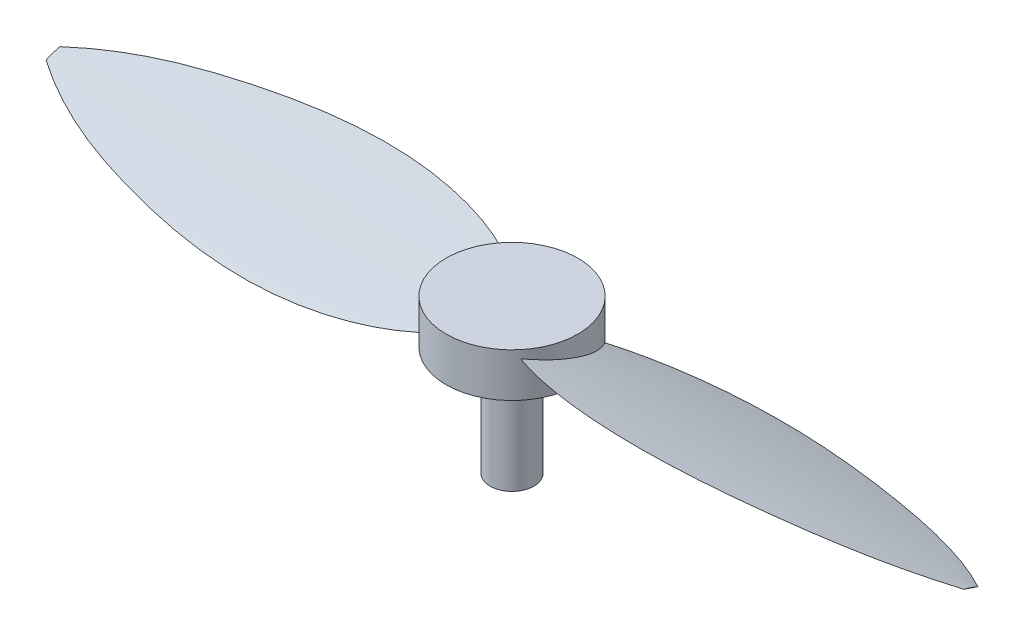
ISO-10303-21;
HEADER;
FILE_DESCRIPTION(('STEP AP214'),'2;1');
FILE_NAME('part.step','',(''),(''),'','','');
FILE_SCHEMA(('AUTOMOTIVE_DESIGN { 1 0 10303 214 1 1 1 1 }'));
ENDSEC;
DATA;
#1=APPLICATION_CONTEXT('core data for automotive mechanical design processes');
#2=APPLICATION_PROTOCOL_DEFINITION('international standard','automotive_design',2000,#1);
#3=PRODUCT_CONTEXT('',#1,'mechanical');
#4=PRODUCT('Part','Part','',(#3));
#5=PRODUCT_RELATED_PRODUCT_CATEGORY('part','',(#4));
#6=PRODUCT_DEFINITION_FORMATION('','',#4);
#7=PRODUCT_DEFINITION_CONTEXT('part definition',#1,'design');
#8=PRODUCT_DEFINITION('design','',#6,#7);
#9=PRODUCT_DEFINITION_SHAPE('','',#8);
#10=(LENGTH_UNIT() NAMED_UNIT(*) SI_UNIT(.MILLI.,.METRE.));
#11=(NAMED_UNIT(*) PLANE_ANGLE_UNIT() SI_UNIT($,.RADIAN.));
#12=(NAMED_UNIT(*) SI_UNIT($,.STERADIAN.) SOLID_ANGLE_UNIT());
#13=UNCERTAINTY_MEASURE_WITH_UNIT(LENGTH_MEASURE(1.E-05),#10,'distance_accuracy_value','');
#14=(GEOMETRIC_REPRESENTATION_CONTEXT(3) GLOBAL_UNCERTAINTY_ASSIGNED_CONTEXT((#13)) GLOBAL_UNIT_ASSIGNED_CONTEXT((#10,
#11,#12)) REPRESENTATION_CONTEXT('',''));
#15=CARTESIAN_POINT('',(0.,0.,0.));
#16=DIRECTION('',(0.,0.,1.));
#17=DIRECTION('',(1.,0.,0.));
#18=AXIS2_PLACEMENT_3D('',#15,#16,#17);
#19=CARTESIAN_POINT('',(0.,10.,0.));
#20=DIRECTION('',(0.,-1.,0.));
#21=DIRECTION('',(0.,0.,-1.));
#22=AXIS2_PLACEMENT_3D('',#19,#20,#21);
#23=CYLINDRICAL_SURFACE('',#22,15.);
#24=CARTESIAN_POINT('',(-11.5286884201092,8.19877308618375,-9.5963192585512));
#25=CARTESIAN_POINT('',(-11.6652468513857,8.16313376279476,-9.43226225900415));
#26=CARTESIAN_POINT('',(-11.7981021452762,8.12581339183943,-9.2655318761139));
#27=CARTESIAN_POINT('',(-12.0562533383928,8.04804373134757,-8.92704145636138));
#28=CARTESIAN_POINT('',(-12.1815497240768,8.00759464354462,-8.75528174422355));
#29=CARTESIAN_POINT('',(-12.5457381490418,7.88195144019499,-8.23312908790252));
#30=CARTESIAN_POINT('',(-12.7731079322483,7.79241429795959,-7.87564785034535));
#31=CARTESIAN_POINT('',(-13.1952518950184,7.60360440650161,-7.14581308880327));
#32=CARTESIAN_POINT('',(-13.3901111788479,7.50435819036564,-6.77350165916444));
#33=CARTESIAN_POINT('',(-13.7471882013149,7.29715981269266,-6.01582914224747));
#34=CARTESIAN_POINT('',(-13.9094027474687,7.18920680112154,-5.63046678295822));
#35=CARTESIAN_POINT('',(-14.2003380869817,6.96586337781367,-4.85010908634994));
#36=CARTESIAN_POINT('',(-14.3291079292759,6.85048417077096,-4.45512879561025));
#37=CARTESIAN_POINT('',(-14.5530919258413,6.61313035568563,-3.65773330904733));
#38=CARTESIAN_POINT('',(-14.6483070908767,6.49115594643733,-3.25531833756263));
#39=CARTESIAN_POINT('',(-14.8050469397441,6.24147187559218,-2.4455532079796));
#40=CARTESIAN_POINT('',(-14.8665573774308,6.11375981347155,-2.03820103728969));
#41=CARTESIAN_POINT('',(-14.9558402523449,5.85351830264545,-1.22133874813671));
#42=CARTESIAN_POINT('',(-14.9836111429985,5.72098863339433,-0.811828531615901));
#43=CARTESIAN_POINT('',(-15.0061253604905,5.44534519482288,0.0269030970964824));
#44=CARTESIAN_POINT('',(-14.9991792996405,5.30203130339145,0.456104627934616));
#45=CARTESIAN_POINT('',(-14.9487203797644,5.01197436522825,1.31118278301544));
#46=CARTESIAN_POINT('',(-14.9052066720966,4.86523123898953,1.73705932986224));
#47=CARTESIAN_POINT('',(-14.7821357483399,4.56916367479017,2.58285965532117));
#48=CARTESIAN_POINT('',(-14.7025637802997,4.41983820442863,3.00278092495886));
#49=CARTESIAN_POINT('',(-14.5080797146132,4.11952521954245,3.83376108207154));
#50=CARTESIAN_POINT('',(-14.3931660868477,3.96853763332938,4.24481958500781));
#51=CARTESIAN_POINT('',(-14.1155761261012,3.65047085655585,5.09613612538101));
#52=CARTESIAN_POINT('',(-13.9492597264101,3.48329980241055,5.53517568483763));
#53=CARTESIAN_POINT('',(-13.5762147320649,3.1487905849986,6.39580314431696));
#54=CARTESIAN_POINT('',(-13.369481929107,2.98145240613703,6.8173892214753));
#55=CARTESIAN_POINT('',(-13.0303744450282,2.73080894205192,7.43400913507674));
#56=CARTESIAN_POINT('',(-12.9124390587029,2.64728095576982,7.63701808369219));
#57=CARTESIAN_POINT('',(-12.667131938539,2.48037916323714,8.0373414757037));
#58=CARTESIAN_POINT('',(-12.5397601853097,2.39700535730374,8.23465590739691));
#59=CARTESIAN_POINT('',(-12.2758632478529,2.2304308946195,8.62312667584135));
#60=CARTESIAN_POINT('',(-12.1393383055586,2.14723023335207,8.81428317515879));
#61=CARTESIAN_POINT('',(-11.8574416510213,1.98094015934387,9.19000941626488));
#62=CARTESIAN_POINT('',(-11.712069896342,1.8978507471387,9.37457912645142));
#63=CARTESIAN_POINT('',(-11.5624302243646,1.81478751264011,9.55563746207968));
#64=B_SPLINE_CURVE_WITH_KNOTS('',3,(#24,#25,#26,#27,#28,#29,#30,#31,#32,#33,#34,#35,#36,#37,#38,
#39,#40,#41,#42,#43,#44,#45,#46,#47,#48,#49,#50,#51,#52,#53,#54,#55,#56,#57,#58,#59,#60,#61,#62,
#63),.UNSPECIFIED.,.F.,.F.,(4,2,2,2,2,2,2,2,2,2,2,2,2,2,2,2,2,2,2,4),(0.,0.64911060452845,
1.29817939049827,2.59547036385044,3.88931018204641,5.18327646954853,6.47533421291324,
7.76735303242024,9.05991753554307,10.3525412857904,11.708661204026,13.0648125952104,
14.4215193089783,15.7782847697149,17.2714365832381,18.7647439520725,19.5121297081154,
20.2595170000091,21.0068845450722,21.7542556753757),.UNSPECIFIED.);
#65=CARTESIAN_POINT('',(-11.5286884201091,8.19877308618375,-9.59631925855125));
#66=VERTEX_POINT('',#65);
#67=CARTESIAN_POINT('',(-11.5624302243646,1.81478751264011,9.55563746207969));
#68=VERTEX_POINT('',#67);
#69=EDGE_CURVE('E84',#66,#68,#64,.T.);
#70=ORIENTED_EDGE('',*,*,#69,.T.);
#71=CARTESIAN_POINT('',(0.,5.,0.));
#72=DIRECTION('',(0.,-0.948683298050514,-0.316227766016838));
#73=DIRECTION('',(0.,-0.316227766016838,0.948683298050514));
#74=AXIS2_PLACEMENT_3D('',#71,#72,#73);
#75=ELLIPSE('',#74,15.8113883008419,15.);
#76=EDGE_CURVE('E42',#68,#66,#75,.T.);
#77=ORIENTED_EDGE('',*,*,#76,.T.);
#78=EDGE_LOOP('',(#70,#77));
#79=FACE_BOUND('',#78,.T.);
#80=CARTESIAN_POINT('',(11.5286884201092,8.19877308618375,9.5963192585512));
#81=CARTESIAN_POINT('',(11.6652468513857,8.16313376279476,9.43226225900415));
#82=CARTESIAN_POINT('',(11.7981021452762,8.12581339183943,9.2655318761139));
#83=CARTESIAN_POINT('',(12.0562533383928,8.04804373134757,8.92704145636138));
#84=CARTESIAN_POINT('',(12.1815497240768,8.00759464354462,8.75528174422355));
#85=CARTESIAN_POINT('',(12.5457381490418,7.88195144019499,8.23312908790252));
#86=CARTESIAN_POINT('',(12.7731079322483,7.79241429795959,7.87564785034535));
#87=CARTESIAN_POINT('',(13.1952518950184,7.60360440650161,7.14581308880327));
#88=CARTESIAN_POINT('',(13.3901111788479,7.50435819036564,6.77350165916444));
#89=CARTESIAN_POINT('',(13.7471882013149,7.29715981269266,6.01582914224747));
#90=CARTESIAN_POINT('',(13.9094027474687,7.18920680112154,5.63046678295822));
#91=CARTESIAN_POINT('',(14.2003380869817,6.96586337781367,4.85010908634993));
#92=CARTESIAN_POINT('',(14.3291079292759,6.85048417077096,4.45512879561024));
#93=CARTESIAN_POINT('',(14.5530919258413,6.61313035568563,3.65773330904732));
#94=CARTESIAN_POINT('',(14.6483070908767,6.49115594643733,3.25531833756262));
#95=CARTESIAN_POINT('',(14.8050469397441,6.24147187559218,2.44555320797959));
#96=CARTESIAN_POINT('',(14.8665573774308,6.11375981347155,2.03820103728968));
#97=CARTESIAN_POINT('',(14.9558402523449,5.85351830264545,1.2213387481367));
#98=CARTESIAN_POINT('',(14.9836111429985,5.72098863339432,0.811828531615893));
#99=CARTESIAN_POINT('',(15.0061253604905,5.44534519482288,-0.0269030970964894));
#100=CARTESIAN_POINT('',(14.9991792996405,5.30203130339145,-0.456104627934623));
#101=CARTESIAN_POINT('',(14.9487203797644,5.01197436522824,-1.31118278301545));
#102=CARTESIAN_POINT('',(14.9052066720966,4.86523123898953,-1.73705932986224));
#103=CARTESIAN_POINT('',(14.7821357483399,4.56916367479017,-2.58285965532117));
#104=CARTESIAN_POINT('',(14.7025637802997,4.41983820442862,-3.00278092495886));
#105=CARTESIAN_POINT('',(14.5080797146132,4.11952521954245,-3.83376108207155));
#106=CARTESIAN_POINT('',(14.3931660868477,3.96853763332937,-4.24481958500781));
#107=CARTESIAN_POINT('',(14.1155761261012,3.65047085655584,-5.09613612538102));
#108=CARTESIAN_POINT('',(13.9492597264101,3.48329980241054,-5.53517568483764));
#109=CARTESIAN_POINT('',(13.5762147320649,3.1487905849986,-6.39580314431696));
#110=CARTESIAN_POINT('',(13.369481929107,2.98145240613703,-6.8173892214753));
#111=CARTESIAN_POINT('',(13.0303744450282,2.73080894205192,-7.43400913507674));
#112=CARTESIAN_POINT('',(12.9124390587029,2.64728095576982,-7.63701808369219));
#113=CARTESIAN_POINT('',(12.667131938539,2.48037916323714,-8.0373414757037));
#114=CARTESIAN_POINT('',(12.5397601853097,2.39700535730374,-8.23465590739691));
#115=CARTESIAN_POINT('',(12.2758632478529,2.2304308946195,-8.62312667584136));
#116=CARTESIAN_POINT('',(12.1393383055586,2.14723023335207,-8.8142831751588));
#117=CARTESIAN_POINT('',(11.8574416510213,1.98094015934387,-9.19000941626488));
#118=CARTESIAN_POINT('',(11.712069896342,1.8978507471387,-9.37457912645142));
#119=CARTESIAN_POINT('',(11.5624302243646,1.81478751264011,-9.55563746207968));
#120=B_SPLINE_CURVE_WITH_KNOTS('',3,(#80,#81,#82,#83,#84,#85,#86,#87,#88,#89,#90,#91,#92,#93,
#94,#95,#96,#97,#98,#99,#100,#101,#102,#103,#104,#105,#106,#107,#108,#109,#110,#111,#112,#113,
#114,#115,#116,#117,#118,#119),.UNSPECIFIED.,.F.,.F.,(4,2,2,2,2,2,2,2,2,2,2,2,2,2,2,2,2,2,2,4),
(0.,0.649110604528452,1.29817939049827,2.59547036385044,3.88931018204642,5.18327646954854,
6.47533421291325,7.76735303242025,9.05991753554308,10.3525412857905,11.708661204026,
13.0648125952104,14.4215193089783,15.7782847697149,17.2714365832382,18.7647439520725,
19.5121297081154,20.2595170000091,21.0068845450722,21.7542556753757),.UNSPECIFIED.);
#121=CARTESIAN_POINT('',(11.5286884201091,8.19877308618375,9.59631925855125));
#122=VERTEX_POINT('',#121);
#123=CARTESIAN_POINT('',(11.5624302243646,1.81478751264011,-9.55563746207969));
#124=VERTEX_POINT('',#123);
#125=EDGE_CURVE('E122',#122,#124,#120,.T.);
#126=ORIENTED_EDGE('',*,*,#125,.T.);
#127=CARTESIAN_POINT('',(0.,5.,0.));
#128=DIRECTION('',(0.,-0.948683298050514,0.316227766016838));
#129=DIRECTION('',(0.,-0.316227766016838,-0.948683298050514));
#130=AXIS2_PLACEMENT_3D('',#127,#128,#129);
#131=ELLIPSE('',#130,15.8113883008419,15.);
#132=EDGE_CURVE('E132',#124,#122,#131,.T.);
#133=ORIENTED_EDGE('',*,*,#132,.T.);
#134=EDGE_LOOP('',(#126,#133));
#135=FACE_BOUND('',#134,.T.);
#136=CARTESIAN_POINT('',(0.,10.,0.));
#137=DIRECTION('',(0.,1.,0.));
#138=DIRECTION('',(0.,0.,1.));
#139=AXIS2_PLACEMENT_3D('',#136,#137,#138);
#140=CIRCLE('',#139,15.);
#141=CARTESIAN_POINT('',(0.,10.,15.));
#142=VERTEX_POINT('',#141);
#143=EDGE_CURVE('E119',#142,#142,#140,.T.);
#144=ORIENTED_EDGE('',*,*,#143,.F.);
#145=EDGE_LOOP('',(#144));
#146=FACE_BOUND('',#145,.T.);
#147=CARTESIAN_POINT('',(0.,0.,0.));
#148=DIRECTION('',(0.,1.,0.));
#149=DIRECTION('',(0.,0.,1.));
#150=AXIS2_PLACEMENT_3D('',#147,#148,#149);
#151=CIRCLE('',#150,15.);
#152=CARTESIAN_POINT('',(0.,0.,15.));
#153=VERTEX_POINT('',#152);
#154=EDGE_CURVE('E116',#153,#153,#151,.T.);
#155=ORIENTED_EDGE('',*,*,#154,.T.);
#156=EDGE_LOOP('',(#155));
#157=FACE_BOUND('',#156,.T.);
#158=ADVANCED_FACE('F38',(#79,#135,#146,#157),#23,.T.);
#159=CARTESIAN_POINT('',(0.,10.,0.));
#160=DIRECTION('',(0.,1.,0.));
#161=DIRECTION('',(0.,0.,1.));
#162=AXIS2_PLACEMENT_3D('',#159,#160,#161);
#163=PLANE('',#162);
#164=ORIENTED_EDGE('',*,*,#143,.T.);
#165=EDGE_LOOP('',(#164));
#166=FACE_BOUND('',#165,.T.);
#167=ADVANCED_FACE('F152',(#166),#163,.T.);
#168=CARTESIAN_POINT('',(0.,0.,0.));
#169=DIRECTION('',(0.,1.,0.));
#170=DIRECTION('',(0.,0.,1.));
#171=AXIS2_PLACEMENT_3D('',#168,#169,#170);
#172=PLANE('',#171);
#173=CARTESIAN_POINT('',(0.,0.,0.));
#174=DIRECTION('',(0.,-1.,0.));
#175=DIRECTION('',(0.,0.,-1.));
#176=AXIS2_PLACEMENT_3D('',#173,#174,#175);
#177=CIRCLE('',#176,5.);
#178=CARTESIAN_POINT('',(0.,0.,-5.));
#179=VERTEX_POINT('',#178);
#180=EDGE_CURVE('E11',#179,#179,#177,.T.);
#181=ORIENTED_EDGE('',*,*,#180,.F.);
#182=EDGE_LOOP('',(#181));
#183=FACE_BOUND('',#182,.T.);
#184=ORIENTED_EDGE('',*,*,#154,.F.);
#185=EDGE_LOOP('',(#184));
#186=FACE_BOUND('',#185,.T.);
#187=ADVANCED_FACE('F141',(#183,#186),#172,.F.);
#188=CARTESIAN_POINT('',(0.,4.51721062059758,-1.44836813820728));
#189=CARTESIAN_POINT('',(7.83558440334098,2.09173103343399,-8.72480689969806));
#190=CARTESIAN_POINT('',(32.2825415930226,-1.35880672951688,-19.0764201885507));
#191=CARTESIAN_POINT('',(69.0409623272103,-0.184551081957399,-15.5536532458721));
#192=CARTESIAN_POINT('',(95.395608688495,2.61364085490183,-7.15907743529444));
#193=CARTESIAN_POINT('',(105.,4.62227655082445,-1.13317034752666));
#194=CARTESIAN_POINT('',(0.,5.33433175875963,-0.319592559802048));
#195=CARTESIAN_POINT('',(7.8716523643627,4.43790876843386,-3.00886153077939));
#196=CARTESIAN_POINT('',(32.2458731746542,3.69918665458095,-7.00022448274553));
#197=CARTESIAN_POINT('',(69.0701995461473,3.97838035331164,-5.74736592884639));
#198=CARTESIAN_POINT('',(95.3671543895042,4.33272047504771,-2.36632542448842));
#199=CARTESIAN_POINT('',(105.,5.082910494969,-0.11575536472461));
#200=CARTESIAN_POINT('',(0.,5.78518065127528,1.03295411774491));
#201=CARTESIAN_POINT('',(7.90772032538442,6.41781425778733,2.93085493728102));
#202=CARTESIAN_POINT('',(32.2092047562859,7.82176937210657,5.3675236698313));
#203=CARTESIAN_POINT('',(69.0994367650842,7.34911116079975,4.36482649361805));
#204=CARTESIAN_POINT('',(95.3387000905133,5.94529093982802,2.47138596985254));
#205=CARTESIAN_POINT('',(105.,5.43703528374799,0.94661900161237));
#206=CARTESIAN_POINT('',(0.,5.80874908778878,2.42624726336633));
#207=CARTESIAN_POINT('',(7.94378828640614,7.97043929113864,8.91131787341588));
#208=CARTESIAN_POINT('',(32.1725363379175,11.0210920883114,18.0632762649341));
#209=CARTESIAN_POINT('',(69.1286739840212,9.90253840279994,14.7076152084));
#210=CARTESIAN_POINT('',(95.3102457915224,7.44567845019493,7.33703535058488));
#211=CARTESIAN_POINT('',(105.,5.67897711811358,2.03693135434074));
#212=B_SPLINE_SURFACE_WITH_KNOTS('',3,3,((#188,#189,#190,#191,#192,#193),(#194,#195,#196,#197,
#198,#199),(#200,#201,#202,#203,#204,#205),(#206,#207,#208,#209,#210,#211)),.UNSPECIFIED.,.F.,
.F.,.F.,(4,4),(4,1,1,4),(0.,1.),(0.,0.246738655582114,0.711329046792689,1.),.UNSPECIFIED.);
#213=CARTESIAN_POINT('',(0.,5.80874908778878,2.42624726336633));
#214=CARTESIAN_POINT('',(7.94378828640613,7.97043929113865,8.91131787341594));
#215=CARTESIAN_POINT('',(32.1725363379175,11.0210920883114,18.0632762649343));
#216=CARTESIAN_POINT('',(69.1286739840212,9.90253840280002,14.7076152084));
#217=CARTESIAN_POINT('',(95.3102457915224,7.44567845019497,7.3370353505849));
#218=CARTESIAN_POINT('',(105.,5.67897711811358,2.03693135434074));
#219=B_SPLINE_CURVE_WITH_KNOTS('',3,(#213,#214,#215,#216,#217,#218),.UNSPECIFIED.,.F.,.F.,(4,1,
1,4),(0.,0.246738655582114,0.711329046792689,1.),.UNSPECIFIED.);
#220=CARTESIAN_POINT('',(105.,5.67897711811358,2.03693135434074));
#221=VERTEX_POINT('',#220);
#222=EDGE_CURVE('E93',#221,#122,#219,.F.);
#223=CARTESIAN_POINT('',(105.,-10.1258959906816,5.54405477845723));
#224=DIRECTION('',(1.,0.,0.));
#225=DIRECTION('',(0.,0.,1.));
#226=AXIS2_PLACEMENT_3D('',#223,#224,#225);
#227=CIRCLE('',#226,16.1893152633798);
#228=CARTESIAN_POINT('',(105.,4.62227655082445,-1.13317034752666));
#229=VERTEX_POINT('',#228);
#230=EDGE_CURVE('E102',#229,#221,#227,.T.);
#231=CARTESIAN_POINT('',(0.,4.51721062059757,-1.44836813820728));
#232=CARTESIAN_POINT('',(7.83558440334098,2.09173103343397,-8.72480689969808));
#233=CARTESIAN_POINT('',(32.2825415930226,-1.3588067295169,-19.0764201885507));
#234=CARTESIAN_POINT('',(69.0409623272103,-0.184551081957358,-15.5536532458721));
#235=CARTESIAN_POINT('',(95.395608688495,2.61364085490185,-7.15907743529444));
#236=CARTESIAN_POINT('',(105.,4.62227655082445,-1.13317034752666));
#237=B_SPLINE_CURVE_WITH_KNOTS('',3,(#231,#232,#233,#234,#235,#236),.UNSPECIFIED.,.F.,.F.,(4,1,
1,4),(0.,0.246738655582114,0.711329046792689,1.),.UNSPECIFIED.);
#238=EDGE_CURVE('E62',#124,#229,#237,.T.);
#239=ORIENTED_EDGE('',*,*,#125,.F.);
#240=ORIENTED_EDGE('',*,*,#222,.F.);
#241=ORIENTED_EDGE('',*,*,#230,.F.);
#242=ORIENTED_EDGE('',*,*,#238,.F.);
#243=EDGE_LOOP('',(#239,#240,#241,#242));
#244=FACE_BOUND('',#243,.T.);
#245=ADVANCED_FACE('F133',(#244),#212,.T.);
#246=CARTESIAN_POINT('',(105.,-10.1258959906816,5.54405477845723));
#247=DIRECTION('',(-1.,0.,0.));
#248=DIRECTION('',(0.,0.,1.));
#249=AXIS2_PLACEMENT_3D('',#246,#247,#248);
#250=PLANE('',#249);
#251=ORIENTED_EDGE('',*,*,#230,.T.);
#252=DIRECTION('',(0.,-0.316227766016838,-0.948683298050514));
#253=VECTOR('',#252,1.);
#254=CARTESIAN_POINT('',(105.,5.67897711811358,2.03693135434074));
#255=LINE('',#254,#253);
#256=EDGE_CURVE('E110',#221,#229,#255,.T.);
#257=ORIENTED_EDGE('',*,*,#256,.T.);
#258=EDGE_LOOP('',(#251,#257));
#259=FACE_BOUND('',#258,.T.);
#260=ADVANCED_FACE('F140',(#259),#250,.F.);
#261=CARTESIAN_POINT('',(0.,5.80874908778878,2.42624726336633));
#262=DIRECTION('',(0.,-0.948683298050514,0.316227766016838));
#263=DIRECTION('',(0.,-0.316227766016838,-0.948683298050514));
#264=AXIS2_PLACEMENT_3D('',#261,#262,#263);
#265=PLANE('',#264);
#266=ORIENTED_EDGE('',*,*,#132,.F.);
#267=ORIENTED_EDGE('',*,*,#238,.T.);
#268=ORIENTED_EDGE('',*,*,#256,.F.);
#269=ORIENTED_EDGE('',*,*,#222,.T.);
#270=EDGE_LOOP('',(#266,#267,#268,#269));
#271=FACE_BOUND('',#270,.T.);
#272=ADVANCED_FACE('F142',(#271),#265,.T.);
#273=CARTESIAN_POINT('',(0.,4.51721062059758,1.44836813820728));
#274=CARTESIAN_POINT('',(-7.83558440334098,2.09173103343399,8.72480689969806));
#275=CARTESIAN_POINT('',(-32.2825415930226,-1.35880672951688,19.0764201885507));
#276=CARTESIAN_POINT('',(-69.0409623272103,-0.184551081957399,15.5536532458721));
#277=CARTESIAN_POINT('',(-95.395608688495,2.61364085490183,7.15907743529444));
#278=CARTESIAN_POINT('',(-105.,4.62227655082445,1.13317034752666));
#279=CARTESIAN_POINT('',(0.,5.33433175875963,0.319592559802048));
#280=CARTESIAN_POINT('',(-7.8716523643627,4.43790876843386,3.00886153077939));
#281=CARTESIAN_POINT('',(-32.2458731746542,3.69918665458095,7.00022448274553));
#282=CARTESIAN_POINT('',(-69.0701995461473,3.97838035331164,5.74736592884639));
#283=CARTESIAN_POINT('',(-95.3671543895042,4.33272047504771,2.36632542448842));
#284=CARTESIAN_POINT('',(-105.,5.082910494969,0.11575536472461));
#285=CARTESIAN_POINT('',(0.,5.78518065127528,-1.03295411774491));
#286=CARTESIAN_POINT('',(-7.90772032538442,6.41781425778733,-2.93085493728102));
#287=CARTESIAN_POINT('',(-32.2092047562859,7.82176937210657,-5.3675236698313));
#288=CARTESIAN_POINT('',(-69.0994367650842,7.34911116079975,-4.36482649361805));
#289=CARTESIAN_POINT('',(-95.3387000905133,5.94529093982802,-2.47138596985254));
#290=CARTESIAN_POINT('',(-105.,5.43703528374799,-0.94661900161237));
#291=CARTESIAN_POINT('',(0.,5.80874908778878,-2.42624726336633));
#292=CARTESIAN_POINT('',(-7.94378828640614,7.97043929113864,-8.91131787341588));
#293=CARTESIAN_POINT('',(-32.1725363379175,11.0210920883114,-18.0632762649341));
#294=CARTESIAN_POINT('',(-69.1286739840212,9.90253840279994,-14.7076152084));
#295=CARTESIAN_POINT('',(-95.3102457915224,7.44567845019493,-7.33703535058488));
#296=CARTESIAN_POINT('',(-105.,5.67897711811358,-2.03693135434074));
#297=B_SPLINE_SURFACE_WITH_KNOTS('',3,3,((#273,#274,#275,#276,#277,#278),(#279,#280,#281,#282,
#283,#284),(#285,#286,#287,#288,#289,#290),(#291,#292,#293,#294,#295,#296)),.UNSPECIFIED.,.F.,
.F.,.F.,(4,4),(4,1,1,4),(0.,1.),(0.,0.246738655582114,0.711329046792689,1.),.UNSPECIFIED.);
#298=CARTESIAN_POINT('',(0.,5.80874908778878,-2.42624726336633));
#299=CARTESIAN_POINT('',(-7.94378828640613,7.97043929113865,-8.91131787341594));
#300=CARTESIAN_POINT('',(-32.1725363379175,11.0210920883114,-18.0632762649343));
#301=CARTESIAN_POINT('',(-69.1286739840212,9.90253840280002,-14.7076152084));
#302=CARTESIAN_POINT('',(-95.3102457915224,7.44567845019497,-7.3370353505849));
#303=CARTESIAN_POINT('',(-105.,5.67897711811358,-2.03693135434074));
#304=B_SPLINE_CURVE_WITH_KNOTS('',3,(#298,#299,#300,#301,#302,#303),.UNSPECIFIED.,.F.,.F.,(4,1,
1,4),(0.,0.246738655582114,0.711329046792689,1.),.UNSPECIFIED.);
#305=CARTESIAN_POINT('',(-105.,5.67897711811358,-2.03693135434074));
#306=VERTEX_POINT('',#305);
#307=EDGE_CURVE('E78',#306,#66,#304,.F.);
#308=CARTESIAN_POINT('',(-105.,-10.1258959906816,-5.54405477845723));
#309=DIRECTION('',(-1.,0.,0.));
#310=DIRECTION('',(0.,0.,-1.));
#311=AXIS2_PLACEMENT_3D('',#308,#309,#310);
#312=CIRCLE('',#311,16.1893152633798);
#313=CARTESIAN_POINT('',(-105.,4.62227655082445,1.13317034752666));
#314=VERTEX_POINT('',#313);
#315=EDGE_CURVE('E82',#314,#306,#312,.T.);
#316=CARTESIAN_POINT('',(0.,4.51721062059757,1.44836813820728));
#317=CARTESIAN_POINT('',(-7.83558440334098,2.09173103343397,8.72480689969808));
#318=CARTESIAN_POINT('',(-32.2825415930226,-1.3588067295169,19.0764201885507));
#319=CARTESIAN_POINT('',(-69.0409623272103,-0.184551081957358,15.5536532458721));
#320=CARTESIAN_POINT('',(-95.395608688495,2.61364085490185,7.15907743529444));
#321=CARTESIAN_POINT('',(-105.,4.62227655082445,1.13317034752666));
#322=B_SPLINE_CURVE_WITH_KNOTS('',3,(#316,#317,#318,#319,#320,#321),.UNSPECIFIED.,.F.,.F.,(4,1,
1,4),(0.,0.246738655582114,0.711329046792689,1.),.UNSPECIFIED.);
#323=EDGE_CURVE('E54',#68,#314,#322,.T.);
#324=ORIENTED_EDGE('',*,*,#69,.F.);
#325=ORIENTED_EDGE('',*,*,#307,.F.);
#326=ORIENTED_EDGE('',*,*,#315,.F.);
#327=ORIENTED_EDGE('',*,*,#323,.F.);
#328=EDGE_LOOP('',(#324,#325,#326,#327));
#329=FACE_BOUND('',#328,.T.);
#330=ADVANCED_FACE('F80',(#329),#297,.T.);
#331=CARTESIAN_POINT('',(-105.,-10.1258959906816,-5.54405477845723));
#332=DIRECTION('',(1.,0.,0.));
#333=DIRECTION('',(0.,0.,-1.));
#334=AXIS2_PLACEMENT_3D('',#331,#332,#333);
#335=PLANE('',#334);
#336=ORIENTED_EDGE('',*,*,#315,.T.);
#337=DIRECTION('',(0.,-0.316227766016838,0.948683298050514));
#338=VECTOR('',#337,1.);
#339=CARTESIAN_POINT('',(-105.,5.67897711811358,-2.03693135434074));
#340=LINE('',#339,#338);
#341=EDGE_CURVE('E90',#306,#314,#340,.T.);
#342=ORIENTED_EDGE('',*,*,#341,.T.);
#343=EDGE_LOOP('',(#336,#342));
#344=FACE_BOUND('',#343,.T.);
#345=ADVANCED_FACE('F95',(#344),#335,.F.);
#346=CARTESIAN_POINT('',(0.,5.80874908778878,-2.42624726336633));
#347=DIRECTION('',(0.,-0.948683298050514,-0.316227766016838));
#348=DIRECTION('',(0.,-0.316227766016838,0.948683298050514));
#349=AXIS2_PLACEMENT_3D('',#346,#347,#348);
#350=PLANE('',#349);
#351=ORIENTED_EDGE('',*,*,#76,.F.);
#352=ORIENTED_EDGE('',*,*,#323,.T.);
#353=ORIENTED_EDGE('',*,*,#341,.F.);
#354=ORIENTED_EDGE('',*,*,#307,.T.);
#355=EDGE_LOOP('',(#351,#352,#353,#354));
#356=FACE_BOUND('',#355,.T.);
#357=ADVANCED_FACE('F91',(#356),#350,.T.);
#358=CARTESIAN_POINT('',(0.,-25.,0.));
#359=DIRECTION('',(0.,1.,0.));
#360=DIRECTION('',(0.,0.,1.));
#361=AXIS2_PLACEMENT_3D('',#358,#359,#360);
#362=CYLINDRICAL_SURFACE('',#361,5.);
#363=CARTESIAN_POINT('',(0.,-25.,0.));
#364=DIRECTION('',(0.,-1.,0.));
#365=DIRECTION('',(0.,0.,-1.));
#366=AXIS2_PLACEMENT_3D('',#363,#364,#365);
#367=CIRCLE('',#366,5.);
#368=CARTESIAN_POINT('',(0.,-25.,-5.));
#369=VERTEX_POINT('',#368);
#370=EDGE_CURVE('E87',#369,#369,#367,.T.);
#371=ORIENTED_EDGE('',*,*,#370,.F.);
#372=EDGE_LOOP('',(#371));
#373=FACE_BOUND('',#372,.T.);
#374=ORIENTED_EDGE('',*,*,#180,.T.);
#375=EDGE_LOOP('',(#374));
#376=FACE_BOUND('',#375,.T.);
#377=ADVANCED_FACE('F193',(#373,#376),#362,.T.);
#378=CARTESIAN_POINT('',(0.,-25.,0.));
#379=DIRECTION('',(0.,-1.,0.));
#380=DIRECTION('',(0.,0.,-1.));
#381=AXIS2_PLACEMENT_3D('',#378,#379,#380);
#382=PLANE('',#381);
#383=ORIENTED_EDGE('',*,*,#370,.T.);
#384=EDGE_LOOP('',(#383));
#385=FACE_BOUND('',#384,.T.);
#386=ADVANCED_FACE('F197',(#385),#382,.T.);
#387=CLOSED_SHELL('',(#158,#167,#187,#245,#260,#272,#330,#345,#357,#377,#386));
#388=MANIFOLD_SOLID_BREP('B2',#387);
#389=ADVANCED_BREP_SHAPE_REPRESENTATION('',(#18,#388),#14);
#390=SHAPE_DEFINITION_REPRESENTATION(#9,#389);
ENDSEC;
END-ISO-10303-21;
